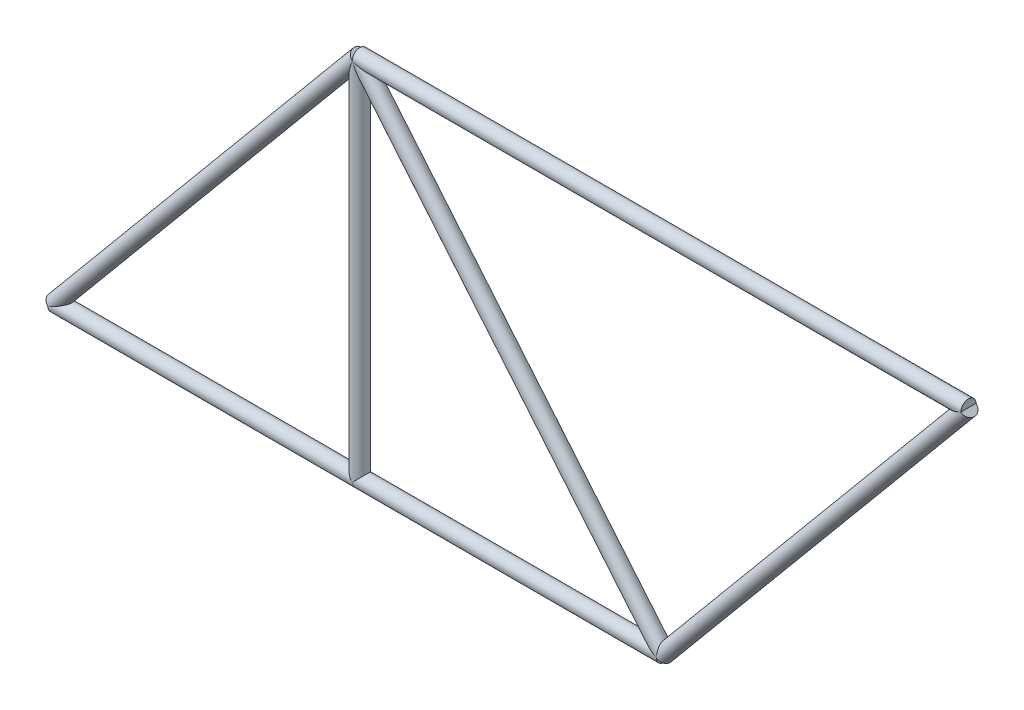
ISO-10303-21;
HEADER;
FILE_DESCRIPTION(('STEP AP214'),'2;1');
FILE_NAME('part.step','',(''),(''),'','','');
FILE_SCHEMA(('AUTOMOTIVE_DESIGN { 1 0 10303 214 1 1 1 1 }'));
ENDSEC;
DATA;
#1=APPLICATION_CONTEXT('core data for automotive mechanical design processes');
#2=APPLICATION_PROTOCOL_DEFINITION('international standard','automotive_design',2000,#1);
#3=PRODUCT_CONTEXT('',#1,'mechanical');
#4=PRODUCT('Part','Part','',(#3));
#5=PRODUCT_RELATED_PRODUCT_CATEGORY('part','',(#4));
#6=PRODUCT_DEFINITION_FORMATION('','',#4);
#7=PRODUCT_DEFINITION_CONTEXT('part definition',#1,'design');
#8=PRODUCT_DEFINITION('design','',#6,#7);
#9=PRODUCT_DEFINITION_SHAPE('','',#8);
#10=(LENGTH_UNIT() NAMED_UNIT(*) SI_UNIT(.MILLI.,.METRE.));
#11=(NAMED_UNIT(*) PLANE_ANGLE_UNIT() SI_UNIT($,.RADIAN.));
#12=(NAMED_UNIT(*) SI_UNIT($,.STERADIAN.) SOLID_ANGLE_UNIT());
#13=UNCERTAINTY_MEASURE_WITH_UNIT(LENGTH_MEASURE(1.E-05),#10,'distance_accuracy_value','');
#14=(GEOMETRIC_REPRESENTATION_CONTEXT(3) GLOBAL_UNCERTAINTY_ASSIGNED_CONTEXT((#13)) GLOBAL_UNIT_ASSIGNED_CONTEXT((#10,
#11,#12)) REPRESENTATION_CONTEXT('',''));
#15=CARTESIAN_POINT('',(0.,0.,0.));
#16=DIRECTION('',(0.,0.,1.));
#17=DIRECTION('',(1.,0.,0.));
#18=AXIS2_PLACEMENT_3D('',#15,#16,#17);
#19=CARTESIAN_POINT('',(5080.,0.,0.));
#20=DIRECTION('',(0.64018439966448,0.768221279597376,0.));
#21=DIRECTION('',(-0.768221279597376,0.64018439966448,0.));
#22=AXIS2_PLACEMENT_3D('',#19,#20,#21);
#23=CYLINDRICAL_SURFACE('',#22,63.5);
#24=CARTESIAN_POINT('',(5080.,-4.44089209850063E-13,0.));
#25=DIRECTION('',(1.,0.,0.));
#26=DIRECTION('',(0.,-1.,0.));
#27=AXIS2_PLACEMENT_3D('',#24,#25,#26);
#28=ELLIPSE('',#27,99.1901708840145,63.5);
#29=CARTESIAN_POINT('',(5080.,-4.44089209850063E-13,-63.5));
#30=VERTEX_POINT('',#29);
#31=CARTESIAN_POINT('',(5080.,-4.44089209850063E-13,63.5));
#32=VERTEX_POINT('',#31);
#33=EDGE_CURVE('E88',#30,#32,#28,.T.);
#34=ORIENTED_EDGE('',*,*,#33,.T.);
#35=CARTESIAN_POINT('',(5080.,-4.44089209850063E-13,0.));
#36=DIRECTION('',(0.90558942122368,0.424155396249724,0.));
#37=DIRECTION('',(0.424155396249724,-0.90558942122368,0.));
#38=AXIS2_PLACEMENT_3D('',#35,#36,#37);
#39=ELLIPSE('',#38,70.1200770589783,63.5);
#40=EDGE_CURVE('E79',#30,#32,#39,.T.);
#41=ORIENTED_EDGE('',*,*,#40,.F.);
#42=EDGE_LOOP('',(#34,#41));
#43=FACE_BOUND('',#42,.T.);
#44=ADVANCED_FACE('F59',(#43),#23,.F.);
#45=CARTESIAN_POINT('',(2540.,-4.44089209850063E-13,0.));
#46=DIRECTION('',(1.,0.,0.));
#47=DIRECTION('',(0.,0.,-1.));
#48=AXIS2_PLACEMENT_3D('',#45,#46,#47);
#49=CYLINDRICAL_SURFACE('',#48,63.5);
#50=CARTESIAN_POINT('',(5080.,-6.66133814775094E-13,0.));
#51=DIRECTION('',(-0.424155396249723,-0.90558942122368,0.));
#52=DIRECTION('',(0.90558942122368,-0.424155396249724,0.));
#53=AXIS2_PLACEMENT_3D('',#50,#51,#52);
#54=ELLIPSE('',#53,149.709282403221,63.5);
#55=EDGE_CURVE('E91',#32,#30,#54,.T.);
#56=ORIENTED_EDGE('',*,*,#55,.T.);
#57=ORIENTED_EDGE('',*,*,#40,.T.);
#58=EDGE_LOOP('',(#56,#57));
#59=FACE_BOUND('',#58,.T.);
#60=ADVANCED_FACE('F61',(#59),#49,.F.);
#61=CARTESIAN_POINT('',(2540.,3048.,0.));
#62=DIRECTION('',(0.64018439966448,-0.768221279597376,0.));
#63=DIRECTION('',(0.768221279597376,0.64018439966448,0.));
#64=AXIS2_PLACEMENT_3D('',#61,#62,#63);
#65=CYLINDRICAL_SURFACE('',#64,63.5);
#66=ORIENTED_EDGE('',*,*,#55,.F.);
#67=ORIENTED_EDGE('',*,*,#33,.F.);
#68=EDGE_LOOP('',(#66,#67));
#69=FACE_BOUND('',#68,.T.);
#70=CARTESIAN_POINT('',(2540.,3048.,0.));
#71=DIRECTION('',(-0.424155396249723,-0.90558942122368,0.));
#72=DIRECTION('',(0.90558942122368,-0.424155396249724,0.));
#73=AXIS2_PLACEMENT_3D('',#70,#71,#72);
#74=ELLIPSE('',#73,149.709282403221,63.5);
#75=CARTESIAN_POINT('',(2540.,3048.,63.5));
#76=VERTEX_POINT('',#75);
#77=CARTESIAN_POINT('',(2540.,3048.,-63.5));
#78=VERTEX_POINT('',#77);
#79=EDGE_CURVE('E13',#76,#78,#74,.F.);
#80=ORIENTED_EDGE('',*,*,#79,.F.);
#81=CARTESIAN_POINT('',(2540.,3048.,0.));
#82=DIRECTION('',(1.,0.,0.));
#83=DIRECTION('',(0.,-1.,0.));
#84=AXIS2_PLACEMENT_3D('',#81,#82,#83);
#85=ELLIPSE('',#84,99.1901708840145,63.5);
#86=EDGE_CURVE('E67',#78,#76,#85,.F.);
#87=ORIENTED_EDGE('',*,*,#86,.F.);
#88=EDGE_LOOP('',(#80,#87));
#89=FACE_BOUND('',#88,.T.);
#90=ADVANCED_FACE('F93',(#69,#89),#65,.T.);
#91=CARTESIAN_POINT('',(2540.,3048.,0.));
#92=DIRECTION('',(-0.64018439966448,-0.768221279597376,0.));
#93=DIRECTION('',(0.768221279597376,-0.64018439966448,0.));
#94=AXIS2_PLACEMENT_3D('',#91,#92,#93);
#95=CYLINDRICAL_SURFACE('',#94,63.5);
#96=ORIENTED_EDGE('',*,*,#86,.T.);
#97=CARTESIAN_POINT('',(2540.,3048.,0.));
#98=DIRECTION('',(-0.90558942122368,-0.424155396249724,0.));
#99=DIRECTION('',(-0.424155396249724,0.90558942122368,0.));
#100=AXIS2_PLACEMENT_3D('',#97,#98,#99);
#101=ELLIPSE('',#100,70.1200770589783,63.5);
#102=EDGE_CURVE('E73',#78,#76,#101,.T.);
#103=ORIENTED_EDGE('',*,*,#102,.F.);
#104=EDGE_LOOP('',(#96,#103));
#105=FACE_BOUND('',#104,.T.);
#106=ADVANCED_FACE('F85',(#105),#95,.F.);
#107=CARTESIAN_POINT('',(7620.,3048.,0.));
#108=DIRECTION('',(-1.,0.,0.));
#109=DIRECTION('',(0.,0.,1.));
#110=AXIS2_PLACEMENT_3D('',#107,#108,#109);
#111=CYLINDRICAL_SURFACE('',#110,63.5);
#112=ORIENTED_EDGE('',*,*,#79,.T.);
#113=ORIENTED_EDGE('',*,*,#102,.T.);
#114=EDGE_LOOP('',(#112,#113));
#115=FACE_BOUND('',#114,.T.);
#116=ADVANCED_FACE('F90',(#115),#111,.F.);
#117=CLOSED_SHELL('',(#44,#60,#90,#106,#116));
#118=MANIFOLD_SOLID_BREP('B2',#117);
#119=CARTESIAN_POINT('',(2540.,0.,0.));
#120=DIRECTION('',(0.,1.,0.));
#121=DIRECTION('',(-1.,0.,0.));
#122=AXIS2_PLACEMENT_3D('',#119,#120,#121);
#123=CYLINDRICAL_SURFACE('',#122,63.5);
#124=CARTESIAN_POINT('',(2540.,-4.44089209850063E-13,0.));
#125=DIRECTION('',(0.707106781186547,0.707106781186548,0.));
#126=DIRECTION('',(-0.707106781186547,0.707106781186547,0.));
#127=AXIS2_PLACEMENT_3D('',#124,#125,#126);
#128=ELLIPSE('',#127,89.8025612106916,63.5);
#129=CARTESIAN_POINT('',(2540.,-4.44089209850063E-13,63.5));
#130=VERTEX_POINT('',#129);
#131=CARTESIAN_POINT('',(2540.,-4.44089209850063E-13,-63.5));
#132=VERTEX_POINT('',#131);
#133=EDGE_CURVE('E204',#130,#132,#128,.F.);
#134=ORIENTED_EDGE('',*,*,#133,.F.);
#135=CARTESIAN_POINT('',(2540.,-4.44089209850063E-13,0.));
#136=DIRECTION('',(-0.707106781186547,0.707106781186547,0.));
#137=DIRECTION('',(0.707106781186547,0.707106781186548,0.));
#138=AXIS2_PLACEMENT_3D('',#135,#136,#137);
#139=ELLIPSE('',#138,89.8025612106916,63.5);
#140=EDGE_CURVE('E206',#132,#130,#139,.F.);
#141=ORIENTED_EDGE('',*,*,#140,.F.);
#142=EDGE_LOOP('',(#134,#141));
#143=FACE_BOUND('',#142,.T.);
#144=CARTESIAN_POINT('',(2540.,3048.,0.));
#145=DIRECTION('',(0.707106781186547,0.707106781186548,0.));
#146=DIRECTION('',(-0.707106781186547,0.707106781186547,0.));
#147=AXIS2_PLACEMENT_3D('',#144,#145,#146);
#148=ELLIPSE('',#147,89.8025612106916,63.5);
#149=CARTESIAN_POINT('',(2540.,3048.,63.5));
#150=VERTEX_POINT('',#149);
#151=CARTESIAN_POINT('',(2540.,3048.,-63.5));
#152=VERTEX_POINT('',#151);
#153=EDGE_CURVE('E209',#150,#152,#148,.T.);
#154=ORIENTED_EDGE('',*,*,#153,.F.);
#155=CARTESIAN_POINT('',(2540.,3048.,0.));
#156=DIRECTION('',(-0.940271577683112,0.340425263753018,0.));
#157=DIRECTION('',(0.340425263753018,0.940271577683112,0.));
#158=AXIS2_PLACEMENT_3D('',#155,#156,#157);
#159=ELLIPSE('',#158,186.53139693554,63.5);
#160=EDGE_CURVE('E57',#152,#150,#159,.T.);
#161=ORIENTED_EDGE('',*,*,#160,.F.);
#162=EDGE_LOOP('',(#154,#161));
#163=FACE_BOUND('',#162,.T.);
#164=ADVANCED_FACE('F181',(#143,#163),#123,.T.);
#165=CARTESIAN_POINT('',(0.,-4.44089209850063E-13,0.));
#166=DIRECTION('',(1.,0.,0.));
#167=DIRECTION('',(0.,0.,-1.));
#168=AXIS2_PLACEMENT_3D('',#165,#166,#167);
#169=CYLINDRICAL_SURFACE('',#168,63.5);
#170=ORIENTED_EDGE('',*,*,#133,.T.);
#171=ORIENTED_EDGE('',*,*,#140,.T.);
#172=EDGE_LOOP('',(#170,#171));
#173=FACE_BOUND('',#172,.T.);
#174=ADVANCED_FACE('F207',(#173),#169,.F.);
#175=CARTESIAN_POINT('',(7620.,3048.,0.));
#176=DIRECTION('',(-1.,0.,0.));
#177=DIRECTION('',(0.,0.,1.));
#178=AXIS2_PLACEMENT_3D('',#175,#176,#177);
#179=CYLINDRICAL_SURFACE('',#178,63.5);
#180=ORIENTED_EDGE('',*,*,#153,.T.);
#181=CARTESIAN_POINT('',(2540.,3048.,0.));
#182=DIRECTION('',(-0.90558942122368,-0.424155396249724,0.));
#183=DIRECTION('',(-0.424155396249724,0.90558942122368,0.));
#184=AXIS2_PLACEMENT_3D('',#181,#182,#183);
#185=ELLIPSE('',#184,70.1200770589783,63.5);
#186=EDGE_CURVE('E185',#152,#150,#185,.T.);
#187=ORIENTED_EDGE('',*,*,#186,.T.);
#188=EDGE_LOOP('',(#180,#187));
#189=FACE_BOUND('',#188,.T.);
#190=ADVANCED_FACE('F183',(#189),#179,.F.);
#191=CARTESIAN_POINT('',(2540.,3048.,0.));
#192=DIRECTION('',(-0.64018439966448,-0.768221279597376,0.));
#193=DIRECTION('',(0.768221279597376,-0.64018439966448,0.));
#194=AXIS2_PLACEMENT_3D('',#191,#192,#193);
#195=CYLINDRICAL_SURFACE('',#194,63.5);
#196=ORIENTED_EDGE('',*,*,#160,.T.);
#197=ORIENTED_EDGE('',*,*,#186,.F.);
#198=EDGE_LOOP('',(#196,#197));
#199=FACE_BOUND('',#198,.T.);
#200=ADVANCED_FACE('F216',(#199),#195,.F.);
#201=CLOSED_SHELL('',(#164,#174,#190,#200));
#202=MANIFOLD_SOLID_BREP('B7',#201);
#203=CARTESIAN_POINT('',(0.,-4.44089209850063E-13,0.));
#204=DIRECTION('',(1.,0.,0.));
#205=DIRECTION('',(0.,0.,-1.));
#206=AXIS2_PLACEMENT_3D('',#203,#204,#205);
#207=CYLINDRICAL_SURFACE('',#206,63.5);
#208=CARTESIAN_POINT('',(0.,-4.44089209850063E-13,0.));
#209=DIRECTION('',(-1.,0.,0.));
#210=DIRECTION('',(0.,-1.,0.));
#211=AXIS2_PLACEMENT_3D('',#208,#209,#210);
#212=CIRCLE('',#211,63.5);
#213=CARTESIAN_POINT('',(0.,-63.5000000000005,0.));
#214=VERTEX_POINT('',#213);
#215=EDGE_CURVE('E180',#214,#214,#212,.T.);
#216=ORIENTED_EDGE('',*,*,#215,.F.);
#217=EDGE_LOOP('',(#216));
#218=FACE_BOUND('',#217,.T.);
#219=CARTESIAN_POINT('',(2540.,-4.44089209850063E-13,0.));
#220=DIRECTION('',(-1.,0.,0.));
#221=DIRECTION('',(0.,-1.,0.));
#222=AXIS2_PLACEMENT_3D('',#219,#220,#221);
#223=CIRCLE('',#222,63.5);
#224=CARTESIAN_POINT('',(2540.,-63.5000000000005,0.));
#225=VERTEX_POINT('',#224);
#226=EDGE_CURVE('E288',#225,#225,#223,.T.);
#227=ORIENTED_EDGE('',*,*,#226,.T.);
#228=EDGE_LOOP('',(#227));
#229=FACE_BOUND('',#228,.T.);
#230=ADVANCED_FACE('F285',(#218,#229),#207,.T.);
#231=CARTESIAN_POINT('',(0.,-4.44089209850063E-13,0.));
#232=DIRECTION('',(-1.,0.,0.));
#233=DIRECTION('',(0.,-1.,0.));
#234=AXIS2_PLACEMENT_3D('',#231,#232,#233);
#235=PLANE('',#234);
#236=ORIENTED_EDGE('',*,*,#215,.T.);
#237=EDGE_LOOP('',(#236));
#238=FACE_BOUND('',#237,.T.);
#239=ADVANCED_FACE('F300',(#238),#235,.T.);
#240=CARTESIAN_POINT('',(2540.,-4.44089209850063E-13,0.));
#241=DIRECTION('',(-1.,0.,0.));
#242=DIRECTION('',(0.,-1.,0.));
#243=AXIS2_PLACEMENT_3D('',#240,#241,#242);
#244=PLANE('',#243);
#245=ORIENTED_EDGE('',*,*,#226,.F.);
#246=EDGE_LOOP('',(#245));
#247=FACE_BOUND('',#246,.T.);
#248=ADVANCED_FACE('F298',(#247),#244,.F.);
#249=CLOSED_SHELL('',(#230,#239,#248));
#250=MANIFOLD_SOLID_BREP('B51',#249);
#251=CARTESIAN_POINT('',(2540.,-4.44089209850063E-13,0.));
#252=DIRECTION('',(1.,0.,0.));
#253=DIRECTION('',(0.,0.,-1.));
#254=AXIS2_PLACEMENT_3D('',#251,#252,#253);
#255=CYLINDRICAL_SURFACE('',#254,63.5);
#256=CARTESIAN_POINT('',(2540.,-4.44089209850063E-13,0.));
#257=DIRECTION('',(-1.,0.,0.));
#258=DIRECTION('',(0.,-1.,0.));
#259=AXIS2_PLACEMENT_3D('',#256,#257,#258);
#260=CIRCLE('',#259,63.5);
#261=CARTESIAN_POINT('',(2540.,-63.5000000000005,0.));
#262=VERTEX_POINT('',#261);
#263=EDGE_CURVE('E284',#262,#262,#260,.T.);
#264=ORIENTED_EDGE('',*,*,#263,.F.);
#265=EDGE_LOOP('',(#264));
#266=FACE_BOUND('',#265,.T.);
#267=CARTESIAN_POINT('',(5080.,-4.44089209850063E-13,0.));
#268=DIRECTION('',(-1.,0.,0.));
#269=DIRECTION('',(0.,-1.,0.));
#270=AXIS2_PLACEMENT_3D('',#267,#268,#269);
#271=CIRCLE('',#270,63.5);
#272=CARTESIAN_POINT('',(5080.,-63.5000000000005,0.));
#273=VERTEX_POINT('',#272);
#274=EDGE_CURVE('E343',#273,#273,#271,.T.);
#275=ORIENTED_EDGE('',*,*,#274,.T.);
#276=EDGE_LOOP('',(#275));
#277=FACE_BOUND('',#276,.T.);
#278=ADVANCED_FACE('F340',(#266,#277),#255,.T.);
#279=CARTESIAN_POINT('',(2540.,-4.44089209850063E-13,0.));
#280=DIRECTION('',(-1.,0.,0.));
#281=DIRECTION('',(0.,-1.,0.));
#282=AXIS2_PLACEMENT_3D('',#279,#280,#281);
#283=PLANE('',#282);
#284=ORIENTED_EDGE('',*,*,#263,.T.);
#285=EDGE_LOOP('',(#284));
#286=FACE_BOUND('',#285,.T.);
#287=ADVANCED_FACE('F355',(#286),#283,.T.);
#288=CARTESIAN_POINT('',(5080.,-4.44089209850063E-13,0.));
#289=DIRECTION('',(-1.,0.,0.));
#290=DIRECTION('',(0.,-1.,0.));
#291=AXIS2_PLACEMENT_3D('',#288,#289,#290);
#292=PLANE('',#291);
#293=ORIENTED_EDGE('',*,*,#274,.F.);
#294=EDGE_LOOP('',(#293));
#295=FACE_BOUND('',#294,.T.);
#296=ADVANCED_FACE('F353',(#295),#292,.F.);
#297=CLOSED_SHELL('',(#278,#287,#296));
#298=MANIFOLD_SOLID_BREP('B175',#297);
#299=CARTESIAN_POINT('',(5080.,2.22044604925031E-13,0.));
#300=DIRECTION('',(0.64018439966448,0.768221279597376,0.));
#301=DIRECTION('',(-0.768221279597376,0.64018439966448,0.));
#302=AXIS2_PLACEMENT_3D('',#299,#300,#301);
#303=CYLINDRICAL_SURFACE('',#302,63.5);
#304=CARTESIAN_POINT('',(5080.,2.22044604925031E-13,0.));
#305=DIRECTION('',(-0.640184399664479,-0.768221279597376,0.));
#306=DIRECTION('',(0.768221279597377,-0.64018439966448,0.));
#307=AXIS2_PLACEMENT_3D('',#304,#305,#306);
#308=CIRCLE('',#307,63.5);
#309=CARTESIAN_POINT('',(5031.21794874557,40.6517093786949,0.));
#310=VERTEX_POINT('',#309);
#311=EDGE_CURVE('E339',#310,#310,#308,.T.);
#312=CARTESIAN_POINT('',(7620.,3048.,0.));
#313=DIRECTION('',(-0.640184399664479,-0.768221279597376,0.));
#314=DIRECTION('',(0.768221279597377,-0.64018439966448,0.));
#315=AXIS2_PLACEMENT_3D('',#312,#313,#314);
#316=CIRCLE('',#315,63.5);
#317=CARTESIAN_POINT('',(7571.21794874557,3088.65170937869,0.));
#318=VERTEX_POINT('',#317);
#319=EDGE_CURVE('E398',#318,#318,#316,.T.);
#320=CARTESIAN_POINT('',(5031.21794874557,40.6517093786949,0.));
#321=CARTESIAN_POINT('',(5057.6762820789,72.4017093786951,0.));
#322=CARTESIAN_POINT('',(5084.13461541223,104.151709378695,0.));
#323=CARTESIAN_POINT('',(5137.0512820789,167.651709378695,0.));
#324=CARTESIAN_POINT('',(5163.50961541223,199.401709378695,0.));
#325=CARTESIAN_POINT('',(5216.4262820789,262.901709378695,0.));
#326=CARTESIAN_POINT('',(5242.88461541223,294.651709378695,0.));
#327=CARTESIAN_POINT('',(5295.8012820789,358.151709378695,0.));
#328=CARTESIAN_POINT('',(5322.25961541223,389.901709378695,0.));
#329=CARTESIAN_POINT('',(5375.1762820789,453.401709378695,0.));
#330=CARTESIAN_POINT('',(5401.63461541223,485.151709378695,0.));
#331=CARTESIAN_POINT('',(5454.5512820789,548.651709378695,0.));
#332=CARTESIAN_POINT('',(5481.00961541223,580.401709378695,0.));
#333=CARTESIAN_POINT('',(5533.9262820789,643.901709378695,0.));
#334=CARTESIAN_POINT('',(5560.38461541223,675.651709378695,0.));
#335=CARTESIAN_POINT('',(5613.3012820789,739.151709378695,0.));
#336=CARTESIAN_POINT('',(5639.75961541223,770.901709378695,0.));
#337=CARTESIAN_POINT('',(5692.6762820789,834.401709378695,0.));
#338=CARTESIAN_POINT('',(5719.13461541223,866.151709378695,0.));
#339=CARTESIAN_POINT('',(5772.0512820789,929.651709378695,0.));
#340=CARTESIAN_POINT('',(5798.50961541223,961.401709378694,0.));
#341=CARTESIAN_POINT('',(5851.4262820789,1024.90170937869,0.));
#342=CARTESIAN_POINT('',(5877.88461541223,1056.65170937869,0.));
#343=CARTESIAN_POINT('',(5930.8012820789,1120.15170937869,0.));
#344=CARTESIAN_POINT('',(5957.25961541223,1151.90170937869,0.));
#345=CARTESIAN_POINT('',(6010.1762820789,1215.40170937869,0.));
#346=CARTESIAN_POINT('',(6036.63461541223,1247.15170937869,0.));
#347=CARTESIAN_POINT('',(6089.5512820789,1310.65170937869,0.));
#348=CARTESIAN_POINT('',(6116.00961541223,1342.40170937869,0.));
#349=CARTESIAN_POINT('',(6168.9262820789,1405.90170937869,0.));
#350=CARTESIAN_POINT('',(6195.38461541223,1437.65170937869,0.));
#351=CARTESIAN_POINT('',(6248.3012820789,1501.15170937869,0.));
#352=CARTESIAN_POINT('',(6274.75961541223,1532.90170937869,0.));
#353=CARTESIAN_POINT('',(6327.6762820789,1596.40170937869,0.));
#354=CARTESIAN_POINT('',(6354.13461541223,1628.15170937869,0.));
#355=CARTESIAN_POINT('',(6407.0512820789,1691.65170937869,0.));
#356=CARTESIAN_POINT('',(6433.50961541223,1723.40170937869,0.));
#357=CARTESIAN_POINT('',(6486.4262820789,1786.90170937869,0.));
#358=CARTESIAN_POINT('',(6512.88461541223,1818.65170937869,0.));
#359=CARTESIAN_POINT('',(6565.8012820789,1882.15170937869,0.));
#360=CARTESIAN_POINT('',(6592.25961541223,1913.90170937869,0.));
#361=CARTESIAN_POINT('',(6645.1762820789,1977.40170937869,0.));
#362=CARTESIAN_POINT('',(6671.63461541223,2009.15170937869,0.));
#363=CARTESIAN_POINT('',(6724.5512820789,2072.65170937869,0.));
#364=CARTESIAN_POINT('',(6751.00961541223,2104.4017093787,0.));
#365=CARTESIAN_POINT('',(6803.9262820789,2167.9017093787,0.));
#366=CARTESIAN_POINT('',(6830.38461541223,2199.65170937869,0.));
#367=CARTESIAN_POINT('',(6883.3012820789,2263.15170937869,0.));
#368=CARTESIAN_POINT('',(6909.75961541223,2294.90170937869,0.));
#369=CARTESIAN_POINT('',(6962.6762820789,2358.4017093787,0.));
#370=CARTESIAN_POINT('',(6989.13461541223,2390.1517093787,0.));
#371=CARTESIAN_POINT('',(7042.0512820789,2453.6517093787,0.));
#372=CARTESIAN_POINT('',(7068.50961541223,2485.40170937869,0.));
#373=CARTESIAN_POINT('',(7121.4262820789,2548.90170937869,0.));
#374=CARTESIAN_POINT('',(7147.88461541223,2580.65170937869,0.));
#375=CARTESIAN_POINT('',(7200.8012820789,2644.15170937869,0.));
#376=CARTESIAN_POINT('',(7227.25961541223,2675.9017093787,0.));
#377=CARTESIAN_POINT('',(7280.1762820789,2739.40170937869,0.));
#378=CARTESIAN_POINT('',(7306.63461541223,2771.15170937869,0.));
#379=CARTESIAN_POINT('',(7359.5512820789,2834.65170937869,0.));
#380=CARTESIAN_POINT('',(7386.00961541223,2866.4017093787,0.));
#381=CARTESIAN_POINT('',(7438.9262820789,2929.9017093787,0.));
#382=CARTESIAN_POINT('',(7465.38461541223,2961.65170937869,0.));
#383=CARTESIAN_POINT('',(7518.3012820789,3025.15170937869,0.));
#384=CARTESIAN_POINT('',(7544.75961541223,3056.90170937869,0.));
#385=CARTESIAN_POINT('',(7571.21794874557,3088.65170937869,0.));
#386=B_SPLINE_CURVE_WITH_KNOTS('',3,(#320,#321,#322,#323,#324,#325,#326,#327,#328,#329,#330,
#331,#332,#333,#334,#335,#336,#337,#338,#339,#340,#341,#342,#343,#344,#345,#346,#347,#348,#349,
#350,#351,#352,#353,#354,#355,#356,#357,#358,#359,#360,#361,#362,#363,#364,#365,#366,#367,#368,
#369,#370,#371,#372,#373,#374,#375,#376,#377,#378,#379,#380,#381,#382,#383,#384,#385),
.UNSPECIFIED.,.F.,.F.,(4,2,2,2,2,2,2,2,2,2,2,2,2,2,2,2,2,2,2,2,2,2,2,2,2,2,2,2,2,2,2,2,4),(0.,
123.987713605018,247.975427210037,371.963140815054,495.950854420072,619.93856802509,
743.926281630109,867.913995235127,991.901708840145,1115.88942244516,1239.87713605018,
1363.8648496552,1487.85256326022,1611.84027686524,1735.82799047025,1859.81570407527,
1983.80341768029,2107.79113128531,2231.77884489033,2355.76655849534,2479.75427210036,
2603.74198570538,2727.7296993104,2851.71741291542,2975.70512652043,3099.69284012545,
3223.68055373047,3347.66826733549,3471.65598094051,3595.64369454553,3719.63140815054,
3843.61912175556,3967.60683536058),.UNSPECIFIED.);
#387=EDGE_CURVE('BSEAM395',#310,#318,#386,.T.);
#388=ORIENTED_EDGE('',*,*,#311,.F.);
#389=ORIENTED_EDGE('',*,*,#319,.T.);
#390=ORIENTED_EDGE('',*,*,#387,.T.);
#391=ORIENTED_EDGE('',*,*,#387,.F.);
#392=EDGE_LOOP('',(#388,#390,#389,#391));
#393=FACE_BOUND('',#392,.T.);
#394=ADVANCED_FACE('F395',(#393),#303,.T.);
#395=CARTESIAN_POINT('',(5080.,2.22044604925031E-13,0.));
#396=DIRECTION('',(-0.640184399664479,-0.768221279597376,0.));
#397=DIRECTION('',(0.768221279597377,-0.64018439966448,0.));
#398=AXIS2_PLACEMENT_3D('',#395,#396,#397);
#399=PLANE('',#398);
#400=ORIENTED_EDGE('',*,*,#311,.T.);
#401=EDGE_LOOP('',(#400));
#402=FACE_BOUND('',#401,.T.);
#403=ADVANCED_FACE('F410',(#402),#399,.T.);
#404=CARTESIAN_POINT('',(7620.,3048.,0.));
#405=DIRECTION('',(-0.640184399664479,-0.768221279597376,0.));
#406=DIRECTION('',(0.768221279597377,-0.64018439966448,0.));
#407=AXIS2_PLACEMENT_3D('',#404,#405,#406);
#408=PLANE('',#407);
#409=ORIENTED_EDGE('',*,*,#319,.F.);
#410=EDGE_LOOP('',(#409));
#411=FACE_BOUND('',#410,.T.);
#412=ADVANCED_FACE('F408',(#411),#408,.F.);
#413=CLOSED_SHELL('',(#394,#403,#412));
#414=MANIFOLD_SOLID_BREP('B279',#413);
#415=CARTESIAN_POINT('',(7620.,3048.,0.));
#416=DIRECTION('',(-1.,0.,0.));
#417=DIRECTION('',(0.,0.,1.));
#418=AXIS2_PLACEMENT_3D('',#415,#416,#417);
#419=CYLINDRICAL_SURFACE('',#418,63.5);
#420=CARTESIAN_POINT('',(7620.,3048.,0.));
#421=DIRECTION('',(1.,0.,0.));
#422=DIRECTION('',(0.,1.,0.));
#423=AXIS2_PLACEMENT_3D('',#420,#421,#422);
#424=CIRCLE('',#423,63.5);
#425=CARTESIAN_POINT('',(7620.,3111.5,0.));
#426=VERTEX_POINT('',#425);
#427=EDGE_CURVE('E394',#426,#426,#424,.T.);
#428=ORIENTED_EDGE('',*,*,#427,.F.);
#429=EDGE_LOOP('',(#428));
#430=FACE_BOUND('',#429,.T.);
#431=CARTESIAN_POINT('',(2540.,3048.,0.));
#432=DIRECTION('',(1.,0.,0.));
#433=DIRECTION('',(0.,1.,0.));
#434=AXIS2_PLACEMENT_3D('',#431,#432,#433);
#435=CIRCLE('',#434,63.5);
#436=CARTESIAN_POINT('',(2540.,3111.5,0.));
#437=VERTEX_POINT('',#436);
#438=EDGE_CURVE('E452',#437,#437,#435,.T.);
#439=ORIENTED_EDGE('',*,*,#438,.T.);
#440=EDGE_LOOP('',(#439));
#441=FACE_BOUND('',#440,.T.);
#442=ADVANCED_FACE('F449',(#430,#441),#419,.T.);
#443=CARTESIAN_POINT('',(7620.,3048.,0.));
#444=DIRECTION('',(1.,0.,0.));
#445=DIRECTION('',(0.,1.,0.));
#446=AXIS2_PLACEMENT_3D('',#443,#444,#445);
#447=PLANE('',#446);
#448=ORIENTED_EDGE('',*,*,#427,.T.);
#449=EDGE_LOOP('',(#448));
#450=FACE_BOUND('',#449,.T.);
#451=ADVANCED_FACE('F466',(#450),#447,.T.);
#452=CARTESIAN_POINT('',(2540.,3048.,0.));
#453=DIRECTION('',(1.,0.,0.));
#454=DIRECTION('',(0.,1.,0.));
#455=AXIS2_PLACEMENT_3D('',#452,#453,#454);
#456=PLANE('',#455);
#457=ORIENTED_EDGE('',*,*,#438,.F.);
#458=EDGE_LOOP('',(#457));
#459=FACE_BOUND('',#458,.T.);
#460=ADVANCED_FACE('F464',(#459),#456,.F.);
#461=CLOSED_SHELL('',(#442,#451,#460));
#462=MANIFOLD_SOLID_BREP('B334',#461);
#463=CARTESIAN_POINT('',(2540.,3048.,0.));
#464=DIRECTION('',(-0.64018439966448,-0.768221279597376,0.));
#465=DIRECTION('',(0.768221279597376,-0.64018439966448,0.));
#466=AXIS2_PLACEMENT_3D('',#463,#464,#465);
#467=CYLINDRICAL_SURFACE('',#466,63.5);
#468=CARTESIAN_POINT('',(2540.,3048.,0.));
#469=DIRECTION('',(0.64018439966448,0.768221279597376,0.));
#470=DIRECTION('',(-0.768221279597376,0.64018439966448,0.));
#471=AXIS2_PLACEMENT_3D('',#468,#469,#470);
#472=CIRCLE('',#471,63.5);
#473=CARTESIAN_POINT('',(2491.21794874557,3088.65170937869,0.));
#474=VERTEX_POINT('',#473);
#475=EDGE_CURVE('E448',#474,#474,#472,.T.);
#476=ORIENTED_EDGE('',*,*,#475,.F.);
#477=EDGE_LOOP('',(#476));
#478=FACE_BOUND('',#477,.T.);
#479=CARTESIAN_POINT('',(-2.22044604925031E-13,0.,0.));
#480=DIRECTION('',(0.64018439966448,0.768221279597376,0.));
#481=DIRECTION('',(-0.768221279597376,0.64018439966448,0.));
#482=AXIS2_PLACEMENT_3D('',#479,#480,#481);
#483=CIRCLE('',#482,63.5);
#484=CARTESIAN_POINT('',(-48.7820512544336,40.6517093786945,0.));
#485=VERTEX_POINT('',#484);
#486=EDGE_CURVE('E501',#485,#485,#483,.T.);
#487=ORIENTED_EDGE('',*,*,#486,.T.);
#488=EDGE_LOOP('',(#487));
#489=FACE_BOUND('',#488,.T.);
#490=ADVANCED_FACE('F498',(#478,#489),#467,.T.);
#491=CARTESIAN_POINT('',(2540.,3048.,0.));
#492=DIRECTION('',(0.64018439966448,0.768221279597376,0.));
#493=DIRECTION('',(-0.768221279597376,0.64018439966448,0.));
#494=AXIS2_PLACEMENT_3D('',#491,#492,#493);
#495=PLANE('',#494);
#496=ORIENTED_EDGE('',*,*,#475,.T.);
#497=EDGE_LOOP('',(#496));
#498=FACE_BOUND('',#497,.T.);
#499=ADVANCED_FACE('F513',(#498),#495,.T.);
#500=CARTESIAN_POINT('',(-2.22044604925031E-13,0.,0.));
#501=DIRECTION('',(0.64018439966448,0.768221279597376,0.));
#502=DIRECTION('',(-0.768221279597376,0.64018439966448,0.));
#503=AXIS2_PLACEMENT_3D('',#500,#501,#502);
#504=PLANE('',#503);
#505=ORIENTED_EDGE('',*,*,#486,.F.);
#506=EDGE_LOOP('',(#505));
#507=FACE_BOUND('',#506,.T.);
#508=ADVANCED_FACE('F511',(#507),#504,.F.);
#509=CLOSED_SHELL('',(#490,#499,#508));
#510=MANIFOLD_SOLID_BREP('B389',#509);
#511=ADVANCED_BREP_SHAPE_REPRESENTATION('',(#18,#118,#202,#250,#298,#414,#462,#510),#14);
#512=SHAPE_DEFINITION_REPRESENTATION(#9,#511);
ENDSEC;
END-ISO-10303-21;
